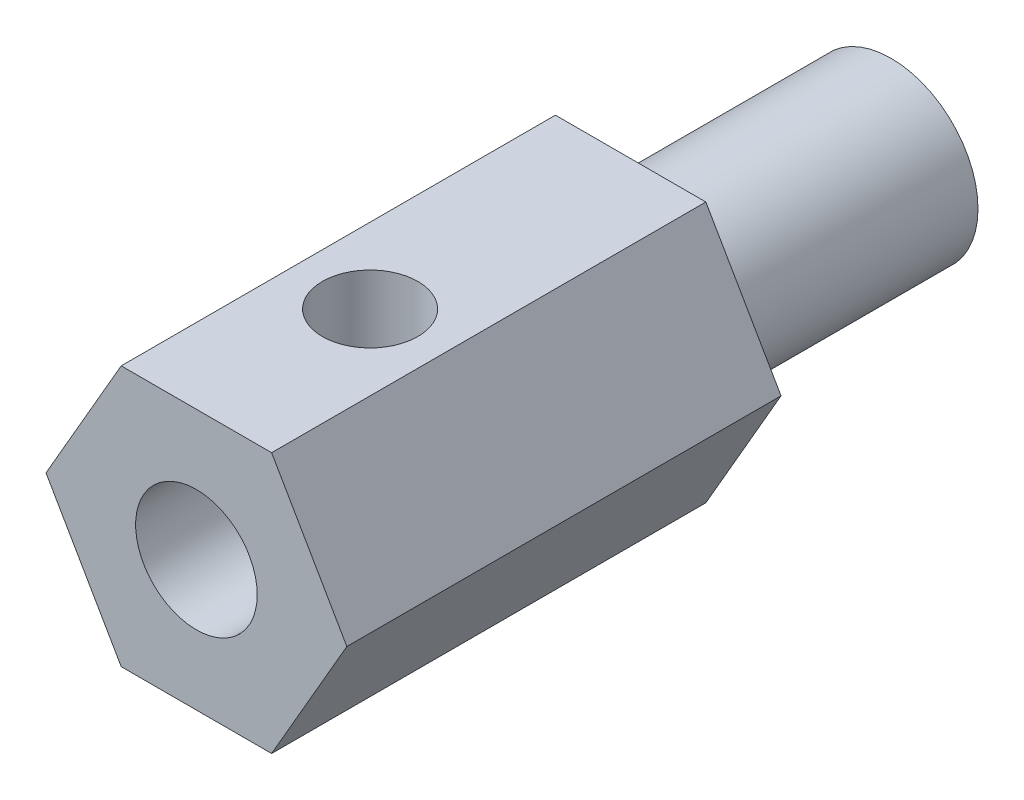
ISO-10303-21;
HEADER;
FILE_DESCRIPTION(('STEP AP214'),'2;1');
FILE_NAME('part.step','',(''),(''),'','','');
FILE_SCHEMA(('AUTOMOTIVE_DESIGN { 1 0 10303 214 1 1 1 1 }'));
ENDSEC;
DATA;
#1=APPLICATION_CONTEXT('core data for automotive mechanical design processes');
#2=APPLICATION_PROTOCOL_DEFINITION('international standard','automotive_design',2000,#1);
#3=PRODUCT_CONTEXT('',#1,'mechanical');
#4=PRODUCT('Part','Part','',(#3));
#5=PRODUCT_RELATED_PRODUCT_CATEGORY('part','',(#4));
#6=PRODUCT_DEFINITION_FORMATION('','',#4);
#7=PRODUCT_DEFINITION_CONTEXT('part definition',#1,'design');
#8=PRODUCT_DEFINITION('design','',#6,#7);
#9=PRODUCT_DEFINITION_SHAPE('','',#8);
#10=(LENGTH_UNIT() NAMED_UNIT(*) SI_UNIT(.MILLI.,.METRE.));
#11=(NAMED_UNIT(*) PLANE_ANGLE_UNIT() SI_UNIT($,.RADIAN.));
#12=(NAMED_UNIT(*) SI_UNIT($,.STERADIAN.) SOLID_ANGLE_UNIT());
#13=UNCERTAINTY_MEASURE_WITH_UNIT(LENGTH_MEASURE(1.E-05),#10,'distance_accuracy_value','');
#14=(GEOMETRIC_REPRESENTATION_CONTEXT(3) GLOBAL_UNCERTAINTY_ASSIGNED_CONTEXT((#13)) GLOBAL_UNIT_ASSIGNED_CONTEXT((#10,
#11,#12)) REPRESENTATION_CONTEXT('',''));
#15=CARTESIAN_POINT('',(0.,0.,0.));
#16=DIRECTION('',(0.,0.,1.));
#17=DIRECTION('',(1.,0.,0.));
#18=AXIS2_PLACEMENT_3D('',#15,#16,#17);
#19=CARTESIAN_POINT('',(4.39940905122495,0.,25.4));
#20=DIRECTION('',(-0.866025403784439,-0.5,0.));
#21=DIRECTION('',(0.5,-0.866025403784439,0.));
#22=AXIS2_PLACEMENT_3D('',#19,#20,#21);
#23=PLANE('',#22);
#24=DIRECTION('',(0.5,-0.866025403784439,0.));
#25=VECTOR('',#24,1.);
#26=CARTESIAN_POINT('',(4.39940905122495,0.,12.7));
#27=LINE('',#26,#25);
#28=CARTESIAN_POINT('',(2.19970452561248,3.81,12.7));
#29=VERTEX_POINT('',#28);
#30=CARTESIAN_POINT('',(4.39940905122495,0.,12.7));
#31=VERTEX_POINT('',#30);
#32=EDGE_CURVE('E51',#29,#31,#27,.T.);
#33=ORIENTED_EDGE('',*,*,#32,.F.);
#34=DIRECTION('',(0.,0.,-1.));
#35=VECTOR('',#34,1.);
#36=CARTESIAN_POINT('',(2.19970452561248,3.81,25.4));
#37=LINE('',#36,#35);
#38=CARTESIAN_POINT('',(2.19970452561248,3.81,25.4));
#39=VERTEX_POINT('',#38);
#40=EDGE_CURVE('E138',#39,#29,#37,.T.);
#41=ORIENTED_EDGE('',*,*,#40,.F.);
#42=DIRECTION('',(-0.5,0.866025403784439,0.));
#43=VECTOR('',#42,1.);
#44=CARTESIAN_POINT('',(4.39940905122495,0.,25.4));
#45=LINE('',#44,#43);
#46=CARTESIAN_POINT('',(4.39940905122495,0.,25.4));
#47=VERTEX_POINT('',#46);
#48=EDGE_CURVE('E177',#47,#39,#45,.T.);
#49=ORIENTED_EDGE('',*,*,#48,.F.);
#50=DIRECTION('',(0.,0.,-1.));
#51=VECTOR('',#50,1.);
#52=CARTESIAN_POINT('',(4.39940905122495,0.,25.4));
#53=LINE('',#52,#51);
#54=EDGE_CURVE('E126',#47,#31,#53,.T.);
#55=ORIENTED_EDGE('',*,*,#54,.T.);
#56=EDGE_LOOP('',(#33,#41,#49,#55));
#57=FACE_BOUND('',#56,.T.);
#58=ADVANCED_FACE('F38',(#57),#23,.F.);
#59=CARTESIAN_POINT('',(2.19970452561248,3.81,25.4));
#60=DIRECTION('',(0.,-1.,0.));
#61=DIRECTION('',(1.,0.,0.));
#62=AXIS2_PLACEMENT_3D('',#59,#60,#61);
#63=PLANE('',#62);
#64=CARTESIAN_POINT('',(0.,3.81,20.32));
#65=DIRECTION('',(0.,1.,0.));
#66=DIRECTION('',(-1.,0.,0.));
#67=AXIS2_PLACEMENT_3D('',#64,#65,#66);
#68=CIRCLE('',#67,1.397);
#69=CARTESIAN_POINT('',(-1.397,3.81,20.32));
#70=VERTEX_POINT('',#69);
#71=EDGE_CURVE('E144',#70,#70,#68,.T.);
#72=ORIENTED_EDGE('',*,*,#71,.F.);
#73=EDGE_LOOP('',(#72));
#74=FACE_BOUND('',#73,.T.);
#75=DIRECTION('',(1.,0.,0.));
#76=VECTOR('',#75,1.);
#77=CARTESIAN_POINT('',(2.19970452561248,3.81,12.7));
#78=LINE('',#77,#76);
#79=CARTESIAN_POINT('',(-2.19970452561247,3.81,12.7));
#80=VERTEX_POINT('',#79);
#81=EDGE_CURVE('E150',#80,#29,#78,.T.);
#82=ORIENTED_EDGE('',*,*,#81,.F.);
#83=DIRECTION('',(0.,0.,-1.));
#84=VECTOR('',#83,1.);
#85=CARTESIAN_POINT('',(-2.19970452561247,3.81,25.4));
#86=LINE('',#85,#84);
#87=CARTESIAN_POINT('',(-2.19970452561247,3.81,25.4));
#88=VERTEX_POINT('',#87);
#89=EDGE_CURVE('E135',#88,#80,#86,.T.);
#90=ORIENTED_EDGE('',*,*,#89,.F.);
#91=DIRECTION('',(-1.,0.,0.));
#92=VECTOR('',#91,1.);
#93=CARTESIAN_POINT('',(2.19970452561248,3.81,25.4));
#94=LINE('',#93,#92);
#95=EDGE_CURVE('E182',#39,#88,#94,.T.);
#96=ORIENTED_EDGE('',*,*,#95,.F.);
#97=ORIENTED_EDGE('',*,*,#40,.T.);
#98=EDGE_LOOP('',(#82,#90,#96,#97));
#99=FACE_BOUND('',#98,.T.);
#100=ADVANCED_FACE('F196',(#74,#99),#63,.F.);
#101=CARTESIAN_POINT('',(-2.19970452561247,3.81,25.4));
#102=DIRECTION('',(0.866025403784439,-0.5,0.));
#103=DIRECTION('',(0.5,0.866025403784439,0.));
#104=AXIS2_PLACEMENT_3D('',#101,#102,#103);
#105=PLANE('',#104);
#106=DIRECTION('',(0.5,0.866025403784439,0.));
#107=VECTOR('',#106,1.);
#108=CARTESIAN_POINT('',(-2.19970452561247,3.81,12.7));
#109=LINE('',#108,#107);
#110=CARTESIAN_POINT('',(-4.39940905122495,0.,12.7));
#111=VERTEX_POINT('',#110);
#112=EDGE_CURVE('E152',#111,#80,#109,.T.);
#113=ORIENTED_EDGE('',*,*,#112,.F.);
#114=DIRECTION('',(0.,0.,-1.));
#115=VECTOR('',#114,1.);
#116=CARTESIAN_POINT('',(-4.39940905122495,0.,25.4));
#117=LINE('',#116,#115);
#118=CARTESIAN_POINT('',(-4.39940905122495,0.,25.4));
#119=VERTEX_POINT('',#118);
#120=EDGE_CURVE('E128',#119,#111,#117,.T.);
#121=ORIENTED_EDGE('',*,*,#120,.F.);
#122=DIRECTION('',(-0.5,-0.866025403784438,0.));
#123=VECTOR('',#122,1.);
#124=CARTESIAN_POINT('',(-2.19970452561247,3.81,25.4));
#125=LINE('',#124,#123);
#126=EDGE_CURVE('E184',#88,#119,#125,.T.);
#127=ORIENTED_EDGE('',*,*,#126,.F.);
#128=ORIENTED_EDGE('',*,*,#89,.T.);
#129=EDGE_LOOP('',(#113,#121,#127,#128));
#130=FACE_BOUND('',#129,.T.);
#131=ADVANCED_FACE('F203',(#130),#105,.F.);
#132=CARTESIAN_POINT('',(-4.39940905122495,0.,25.4));
#133=DIRECTION('',(0.866025403784439,0.5,0.));
#134=DIRECTION('',(-0.5,0.866025403784439,0.));
#135=AXIS2_PLACEMENT_3D('',#132,#133,#134);
#136=PLANE('',#135);
#137=DIRECTION('',(-0.5,0.866025403784439,0.));
#138=VECTOR('',#137,1.);
#139=CARTESIAN_POINT('',(-4.39940905122495,0.,12.7));
#140=LINE('',#139,#138);
#141=CARTESIAN_POINT('',(-2.19970452561248,-3.81,12.7));
#142=VERTEX_POINT('',#141);
#143=EDGE_CURVE('E121',#142,#111,#140,.T.);
#144=ORIENTED_EDGE('',*,*,#143,.F.);
#145=DIRECTION('',(0.,0.,-1.));
#146=VECTOR('',#145,1.);
#147=CARTESIAN_POINT('',(-2.19970452561248,-3.81,25.4));
#148=LINE('',#147,#146);
#149=CARTESIAN_POINT('',(-2.19970452561248,-3.81,25.4));
#150=VERTEX_POINT('',#149);
#151=EDGE_CURVE('E120',#150,#142,#148,.T.);
#152=ORIENTED_EDGE('',*,*,#151,.F.);
#153=DIRECTION('',(0.5,-0.866025403784439,0.));
#154=VECTOR('',#153,1.);
#155=CARTESIAN_POINT('',(-4.39940905122495,0.,25.4));
#156=LINE('',#155,#154);
#157=EDGE_CURVE('E186',#119,#150,#156,.T.);
#158=ORIENTED_EDGE('',*,*,#157,.F.);
#159=ORIENTED_EDGE('',*,*,#120,.T.);
#160=EDGE_LOOP('',(#144,#152,#158,#159));
#161=FACE_BOUND('',#160,.T.);
#162=ADVANCED_FACE('F205',(#161),#136,.F.);
#163=CARTESIAN_POINT('',(-2.19970452561248,-3.81,25.4));
#164=DIRECTION('',(0.,1.,0.));
#165=DIRECTION('',(-1.,0.,0.));
#166=AXIS2_PLACEMENT_3D('',#163,#164,#165);
#167=PLANE('',#166);
#168=DIRECTION('',(-1.,0.,0.));
#169=VECTOR('',#168,1.);
#170=CARTESIAN_POINT('',(-2.19970452561248,-3.81,12.7));
#171=LINE('',#170,#169);
#172=CARTESIAN_POINT('',(2.19970452561247,-3.81,12.7));
#173=VERTEX_POINT('',#172);
#174=EDGE_CURVE('E106',#173,#142,#171,.T.);
#175=ORIENTED_EDGE('',*,*,#174,.F.);
#176=DIRECTION('',(0.,0.,-1.));
#177=VECTOR('',#176,1.);
#178=CARTESIAN_POINT('',(2.19970452561247,-3.81,25.4));
#179=LINE('',#178,#177);
#180=CARTESIAN_POINT('',(2.19970452561247,-3.81,25.4));
#181=VERTEX_POINT('',#180);
#182=EDGE_CURVE('E117',#181,#173,#179,.T.);
#183=ORIENTED_EDGE('',*,*,#182,.F.);
#184=DIRECTION('',(1.,0.,0.));
#185=VECTOR('',#184,1.);
#186=CARTESIAN_POINT('',(-2.19970452561248,-3.81,25.4));
#187=LINE('',#186,#185);
#188=EDGE_CURVE('E188',#150,#181,#187,.T.);
#189=ORIENTED_EDGE('',*,*,#188,.F.);
#190=ORIENTED_EDGE('',*,*,#151,.T.);
#191=EDGE_LOOP('',(#175,#183,#189,#190));
#192=FACE_BOUND('',#191,.T.);
#193=ADVANCED_FACE('F115',(#192),#167,.F.);
#194=CARTESIAN_POINT('',(2.19970452561247,-3.81,25.4));
#195=DIRECTION('',(-0.866025403784438,0.5,0.));
#196=DIRECTION('',(-0.5,-0.866025403784438,0.));
#197=AXIS2_PLACEMENT_3D('',#194,#195,#196);
#198=PLANE('',#197);
#199=DIRECTION('',(-0.5,-0.866025403784438,0.));
#200=VECTOR('',#199,1.);
#201=CARTESIAN_POINT('',(2.19970452561247,-3.81,12.7));
#202=LINE('',#201,#200);
#203=EDGE_CURVE('E11',#31,#173,#202,.T.);
#204=ORIENTED_EDGE('',*,*,#203,.F.);
#205=ORIENTED_EDGE('',*,*,#54,.F.);
#206=DIRECTION('',(0.5,0.866025403784438,0.));
#207=VECTOR('',#206,1.);
#208=CARTESIAN_POINT('',(2.19970452561247,-3.81,25.4));
#209=LINE('',#208,#207);
#210=EDGE_CURVE('E125',#181,#47,#209,.T.);
#211=ORIENTED_EDGE('',*,*,#210,.F.);
#212=ORIENTED_EDGE('',*,*,#182,.T.);
#213=EDGE_LOOP('',(#204,#205,#211,#212));
#214=FACE_BOUND('',#213,.T.);
#215=ADVANCED_FACE('F124',(#214),#198,.F.);
#216=CARTESIAN_POINT('',(0.,0.,5.08));
#217=DIRECTION('',(0.,0.,-1.));
#218=DIRECTION('',(-1.,0.,0.));
#219=AXIS2_PLACEMENT_3D('',#216,#217,#218);
#220=PLANE('',#219);
#221=CARTESIAN_POINT('',(0.,0.,5.08));
#222=DIRECTION('',(0.,0.,-1.));
#223=DIRECTION('',(-1.,0.,0.));
#224=AXIS2_PLACEMENT_3D('',#221,#222,#223);
#225=CIRCLE('',#224,1.524);
#226=CARTESIAN_POINT('',(-1.524,0.,5.08));
#227=VERTEX_POINT('',#226);
#228=EDGE_CURVE('E142',#227,#227,#225,.F.);
#229=ORIENTED_EDGE('',*,*,#228,.T.);
#230=EDGE_LOOP('',(#229));
#231=FACE_BOUND('',#230,.T.);
#232=CARTESIAN_POINT('',(0.,0.,5.08));
#233=DIRECTION('',(0.,0.,-1.));
#234=DIRECTION('',(-1.,0.,0.));
#235=AXIS2_PLACEMENT_3D('',#232,#233,#234);
#236=CIRCLE('',#235,2.54);
#237=CARTESIAN_POINT('',(-2.54,0.,5.08));
#238=VERTEX_POINT('',#237);
#239=EDGE_CURVE('E208',#238,#238,#236,.T.);
#240=ORIENTED_EDGE('',*,*,#239,.T.);
#241=EDGE_LOOP('',(#240));
#242=FACE_BOUND('',#241,.T.);
#243=ADVANCED_FACE('F247',(#231,#242),#220,.T.);
#244=CARTESIAN_POINT('',(0.,0.,20.8205229381132));
#245=DIRECTION('',(0.,0.,-1.));
#246=DIRECTION('',(-1.,0.,0.));
#247=AXIS2_PLACEMENT_3D('',#244,#245,#246);
#248=CYLINDRICAL_SURFACE('',#247,1.524);
#249=CARTESIAN_POINT('',(0.,0.,16.51));
#250=DIRECTION('',(0.,0.,1.));
#251=DIRECTION('',(1.,0.,0.));
#252=AXIS2_PLACEMENT_3D('',#249,#250,#251);
#253=CIRCLE('',#252,1.524);
#254=CARTESIAN_POINT('',(-1.13592253256989,1.016,16.51));
#255=VERTEX_POINT('',#254);
#256=CARTESIAN_POINT('',(1.13592253256989,1.016,16.51));
#257=VERTEX_POINT('',#256);
#258=EDGE_CURVE('E58',#255,#257,#253,.F.);
#259=ORIENTED_EDGE('',*,*,#258,.F.);
#260=EDGE_CURVE('E158',#257,#255,#253,.F.);
#261=ORIENTED_EDGE('',*,*,#260,.F.);
#262=EDGE_LOOP('',(#259,#261));
#263=FACE_BOUND('',#262,.T.);
#264=ORIENTED_EDGE('',*,*,#228,.F.);
#265=EDGE_LOOP('',(#264));
#266=FACE_BOUND('',#265,.T.);
#267=ADVANCED_FACE('F259',(#263,#266),#248,.F.);
#268=CARTESIAN_POINT('',(0.,1.016,16.51));
#269=DIRECTION('',(0.,-1.,0.));
#270=DIRECTION('',(0.,0.,-1.));
#271=AXIS2_PLACEMENT_3D('',#268,#269,#270);
#272=PLANE('',#271);
#273=CARTESIAN_POINT('',(0.,1.016,20.32));
#274=DIRECTION('',(0.,-1.,0.));
#275=DIRECTION('',(0.,0.,-1.));
#276=AXIS2_PLACEMENT_3D('',#273,#274,#275);
#277=CIRCLE('',#276,1.397);
#278=CARTESIAN_POINT('',(0.,1.016,18.923));
#279=VERTEX_POINT('',#278);
#280=EDGE_CURVE('E148',#279,#279,#277,.T.);
#281=ORIENTED_EDGE('',*,*,#280,.F.);
#282=EDGE_LOOP('',(#281));
#283=FACE_BOUND('',#282,.T.);
#284=DIRECTION('',(0.,0.,1.));
#285=VECTOR('',#284,1.);
#286=CARTESIAN_POINT('',(1.45911891222066,1.016,16.51));
#287=LINE('',#286,#285);
#288=CARTESIAN_POINT('',(1.45911891222066,1.016,16.51));
#289=VERTEX_POINT('',#288);
#290=CARTESIAN_POINT('',(1.45911891222066,1.016,22.86));
#291=VERTEX_POINT('',#290);
#292=EDGE_CURVE('E170',#289,#291,#287,.T.);
#293=ORIENTED_EDGE('',*,*,#292,.T.);
#294=DIRECTION('',(-1.,0.,0.));
#295=VECTOR('',#294,1.);
#296=CARTESIAN_POINT('',(0.,1.016,22.86));
#297=LINE('',#296,#295);
#298=CARTESIAN_POINT('',(-1.45911891222066,1.016,22.86));
#299=VERTEX_POINT('',#298);
#300=EDGE_CURVE('E45',#291,#299,#297,.T.);
#301=ORIENTED_EDGE('',*,*,#300,.T.);
#302=DIRECTION('',(0.,0.,1.));
#303=VECTOR('',#302,1.);
#304=CARTESIAN_POINT('',(-1.45911891222066,1.016,16.51));
#305=LINE('',#304,#303);
#306=CARTESIAN_POINT('',(-1.45911891222066,1.016,16.51));
#307=VERTEX_POINT('',#306);
#308=EDGE_CURVE('E174',#307,#299,#305,.T.);
#309=ORIENTED_EDGE('',*,*,#308,.F.);
#310=DIRECTION('',(1.,0.,0.));
#311=VECTOR('',#310,1.);
#312=CARTESIAN_POINT('',(0.,1.016,16.51));
#313=LINE('',#312,#311);
#314=EDGE_CURVE('E167',#307,#255,#313,.T.);
#315=ORIENTED_EDGE('',*,*,#314,.T.);
#316=EDGE_CURVE('E171',#255,#257,#313,.T.);
#317=ORIENTED_EDGE('',*,*,#316,.T.);
#318=EDGE_CURVE('E166',#257,#289,#313,.T.);
#319=ORIENTED_EDGE('',*,*,#318,.T.);
#320=EDGE_LOOP('',(#293,#301,#309,#315,#317,#319));
#321=FACE_BOUND('',#320,.T.);
#322=ADVANCED_FACE('F251',(#283,#321),#272,.T.);
#323=CARTESIAN_POINT('',(0.,0.,25.4));
#324=DIRECTION('',(0.,0.,1.));
#325=DIRECTION('',(1.,0.,0.));
#326=AXIS2_PLACEMENT_3D('',#323,#324,#325);
#327=PLANE('',#326);
#328=CARTESIAN_POINT('',(0.,0.,25.4));
#329=DIRECTION('',(0.,0.,1.));
#330=DIRECTION('',(1.,0.,0.));
#331=AXIS2_PLACEMENT_3D('',#328,#329,#330);
#332=CIRCLE('',#331,1.778);
#333=CARTESIAN_POINT('',(1.778,0.,25.4));
#334=VERTEX_POINT('',#333);
#335=EDGE_CURVE('E162',#334,#334,#332,.T.);
#336=ORIENTED_EDGE('',*,*,#335,.F.);
#337=EDGE_LOOP('',(#336));
#338=FACE_BOUND('',#337,.T.);
#339=ORIENTED_EDGE('',*,*,#48,.T.);
#340=ORIENTED_EDGE('',*,*,#95,.T.);
#341=ORIENTED_EDGE('',*,*,#126,.T.);
#342=ORIENTED_EDGE('',*,*,#157,.T.);
#343=ORIENTED_EDGE('',*,*,#188,.T.);
#344=ORIENTED_EDGE('',*,*,#210,.T.);
#345=EDGE_LOOP('',(#339,#340,#341,#342,#343,#344));
#346=FACE_BOUND('',#345,.T.);
#347=ADVANCED_FACE('F190',(#338,#346),#327,.T.);
#348=CARTESIAN_POINT('',(0.,0.,16.51));
#349=DIRECTION('',(0.,0.,1.));
#350=DIRECTION('',(1.,0.,0.));
#351=AXIS2_PLACEMENT_3D('',#348,#349,#350);
#352=CYLINDRICAL_SURFACE('',#351,1.778);
#353=ORIENTED_EDGE('',*,*,#335,.T.);
#354=EDGE_LOOP('',(#353));
#355=FACE_BOUND('',#354,.T.);
#356=CARTESIAN_POINT('',(0.,0.,22.86));
#357=DIRECTION('',(0.,0.,1.));
#358=DIRECTION('',(1.,0.,0.));
#359=AXIS2_PLACEMENT_3D('',#356,#357,#358);
#360=CIRCLE('',#359,1.778);
#361=EDGE_CURVE('E160',#291,#299,#360,.T.);
#362=ORIENTED_EDGE('',*,*,#361,.F.);
#363=ORIENTED_EDGE('',*,*,#292,.F.);
#364=CARTESIAN_POINT('',(0.,0.,16.51));
#365=DIRECTION('',(0.,0.,1.));
#366=DIRECTION('',(1.,0.,0.));
#367=AXIS2_PLACEMENT_3D('',#364,#365,#366);
#368=CIRCLE('',#367,1.778);
#369=EDGE_CURVE('E163',#307,#289,#368,.T.);
#370=ORIENTED_EDGE('',*,*,#369,.F.);
#371=ORIENTED_EDGE('',*,*,#308,.T.);
#372=EDGE_LOOP('',(#362,#363,#370,#371));
#373=FACE_BOUND('',#372,.T.);
#374=ADVANCED_FACE('F250',(#355,#373),#352,.F.);
#375=CARTESIAN_POINT('',(0.,0.,16.51));
#376=DIRECTION('',(0.,0.,1.));
#377=DIRECTION('',(1.,0.,0.));
#378=AXIS2_PLACEMENT_3D('',#375,#376,#377);
#379=PLANE('',#378);
#380=ORIENTED_EDGE('',*,*,#318,.F.);
#381=ORIENTED_EDGE('',*,*,#260,.T.);
#382=ORIENTED_EDGE('',*,*,#314,.F.);
#383=ORIENTED_EDGE('',*,*,#369,.T.);
#384=EDGE_LOOP('',(#380,#381,#382,#383));
#385=FACE_BOUND('',#384,.T.);
#386=ADVANCED_FACE('F255',(#385),#379,.T.);
#387=CARTESIAN_POINT('',(0.,0.,22.86));
#388=DIRECTION('',(0.,0.,1.));
#389=DIRECTION('',(1.,0.,0.));
#390=AXIS2_PLACEMENT_3D('',#387,#388,#389);
#391=PLANE('',#390);
#392=ORIENTED_EDGE('',*,*,#361,.T.);
#393=ORIENTED_EDGE('',*,*,#300,.F.);
#394=EDGE_LOOP('',(#392,#393));
#395=FACE_BOUND('',#394,.T.);
#396=ADVANCED_FACE('F263',(#395),#391,.T.);
#397=CARTESIAN_POINT('',(0.,0.,16.51));
#398=DIRECTION('',(0.,0.,1.));
#399=DIRECTION('',(1.,0.,0.));
#400=AXIS2_PLACEMENT_3D('',#397,#398,#399);
#401=PLANE('',#400);
#402=ORIENTED_EDGE('',*,*,#258,.T.);
#403=ORIENTED_EDGE('',*,*,#316,.F.);
#404=EDGE_LOOP('',(#402,#403));
#405=FACE_BOUND('',#404,.T.);
#406=ADVANCED_FACE('F226',(#405),#401,.F.);
#407=CARTESIAN_POINT('',(0.,0.,20.32));
#408=DIRECTION('',(0.,1.,0.));
#409=DIRECTION('',(-1.,0.,0.));
#410=AXIS2_PLACEMENT_3D('',#407,#408,#409);
#411=CYLINDRICAL_SURFACE('',#410,1.397);
#412=ORIENTED_EDGE('',*,*,#280,.T.);
#413=EDGE_LOOP('',(#412));
#414=FACE_BOUND('',#413,.T.);
#415=ORIENTED_EDGE('',*,*,#71,.T.);
#416=EDGE_LOOP('',(#415));
#417=FACE_BOUND('',#416,.T.);
#418=ADVANCED_FACE('F218',(#414,#417),#411,.F.);
#419=CARTESIAN_POINT('',(0.,0.,12.7));
#420=DIRECTION('',(0.,0.,-1.));
#421=DIRECTION('',(-1.,0.,0.));
#422=AXIS2_PLACEMENT_3D('',#419,#420,#421);
#423=PLANE('',#422);
#424=CARTESIAN_POINT('',(0.,0.,12.7));
#425=DIRECTION('',(0.,0.,-1.));
#426=DIRECTION('',(-1.,0.,0.));
#427=AXIS2_PLACEMENT_3D('',#424,#425,#426);
#428=CIRCLE('',#427,2.54);
#429=CARTESIAN_POINT('',(-2.54,0.,12.7));
#430=VERTEX_POINT('',#429);
#431=EDGE_CURVE('E122',#430,#430,#428,.T.);
#432=ORIENTED_EDGE('',*,*,#431,.F.);
#433=EDGE_LOOP('',(#432));
#434=FACE_BOUND('',#433,.T.);
#435=ORIENTED_EDGE('',*,*,#32,.T.);
#436=ORIENTED_EDGE('',*,*,#203,.T.);
#437=ORIENTED_EDGE('',*,*,#174,.T.);
#438=ORIENTED_EDGE('',*,*,#143,.T.);
#439=ORIENTED_EDGE('',*,*,#112,.T.);
#440=ORIENTED_EDGE('',*,*,#81,.T.);
#441=EDGE_LOOP('',(#435,#436,#437,#438,#439,#440));
#442=FACE_BOUND('',#441,.T.);
#443=ADVANCED_FACE('F105',(#434,#442),#423,.T.);
#444=CARTESIAN_POINT('',(0.,0.,12.7));
#445=DIRECTION('',(0.,0.,-1.));
#446=DIRECTION('',(-1.,0.,0.));
#447=AXIS2_PLACEMENT_3D('',#444,#445,#446);
#448=CYLINDRICAL_SURFACE('',#447,2.54);
#449=ORIENTED_EDGE('',*,*,#431,.T.);
#450=EDGE_LOOP('',(#449));
#451=FACE_BOUND('',#450,.T.);
#452=ORIENTED_EDGE('',*,*,#239,.F.);
#453=EDGE_LOOP('',(#452));
#454=FACE_BOUND('',#453,.T.);
#455=ADVANCED_FACE('F214',(#451,#454),#448,.T.);
#456=CLOSED_SHELL('',(#58,#100,#131,#162,#193,#215,#243,#267,#322,#347,#374,#386,#396,#406,#418,
#443,#455));
#457=MANIFOLD_SOLID_BREP('B2',#456);
#458=ADVANCED_BREP_SHAPE_REPRESENTATION('',(#18,#457),#14);
#459=SHAPE_DEFINITION_REPRESENTATION(#9,#458);
ENDSEC;
END-ISO-10303-21;
